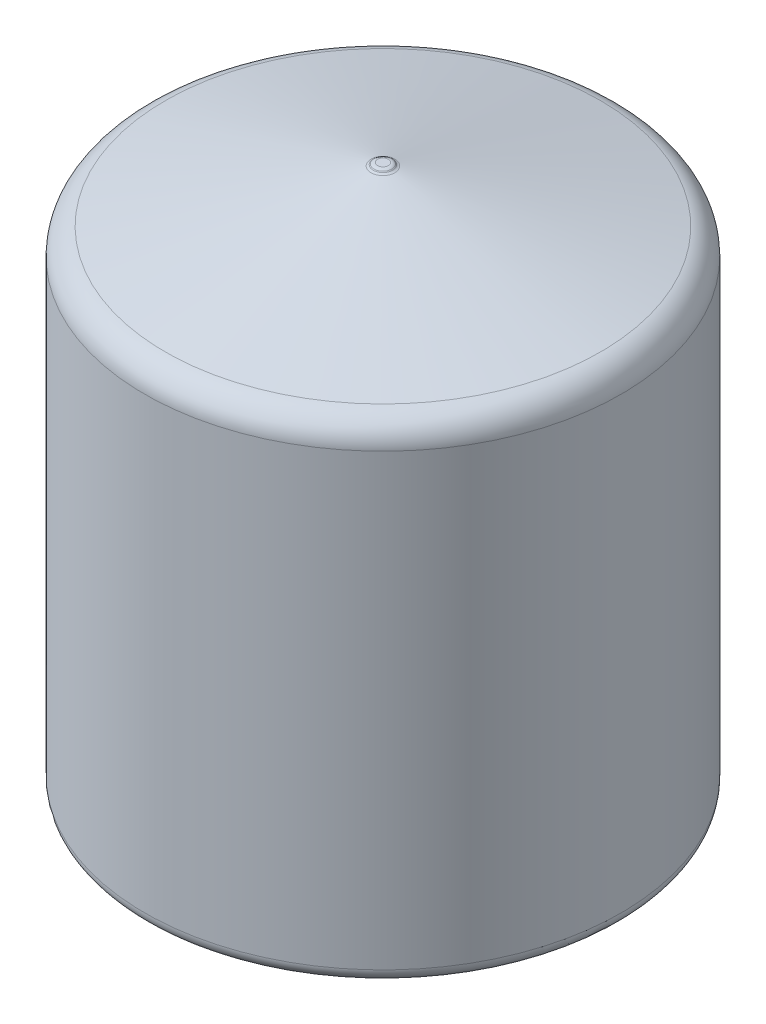
ISO-10303-21;
HEADER;
FILE_DESCRIPTION(('STEP AP214'),'2;1');
FILE_NAME('part.step','',(''),(''),'','','');
FILE_SCHEMA(('AUTOMOTIVE_DESIGN { 1 0 10303 214 1 1 1 1 }'));
ENDSEC;
DATA;
#1=APPLICATION_CONTEXT('core data for automotive mechanical design processes');
#2=APPLICATION_PROTOCOL_DEFINITION('international standard','automotive_design',2000,#1);
#3=PRODUCT_CONTEXT('',#1,'mechanical');
#4=PRODUCT('Part','Part','',(#3));
#5=PRODUCT_RELATED_PRODUCT_CATEGORY('part','',(#4));
#6=PRODUCT_DEFINITION_FORMATION('','',#4);
#7=PRODUCT_DEFINITION_CONTEXT('part definition',#1,'design');
#8=PRODUCT_DEFINITION('design','',#6,#7);
#9=PRODUCT_DEFINITION_SHAPE('','',#8);
#10=(LENGTH_UNIT() NAMED_UNIT(*) SI_UNIT(.MILLI.,.METRE.));
#11=(NAMED_UNIT(*) PLANE_ANGLE_UNIT() SI_UNIT($,.RADIAN.));
#12=(NAMED_UNIT(*) SI_UNIT($,.STERADIAN.) SOLID_ANGLE_UNIT());
#13=UNCERTAINTY_MEASURE_WITH_UNIT(LENGTH_MEASURE(1.E-05),#10,'distance_accuracy_value','');
#14=(GEOMETRIC_REPRESENTATION_CONTEXT(3) GLOBAL_UNCERTAINTY_ASSIGNED_CONTEXT((#13)) GLOBAL_UNIT_ASSIGNED_CONTEXT((#10,
#11,#12)) REPRESENTATION_CONTEXT('',''));
#15=CARTESIAN_POINT('',(0.,0.,0.));
#16=DIRECTION('',(0.,0.,1.));
#17=DIRECTION('',(1.,0.,0.));
#18=AXIS2_PLACEMENT_3D('',#15,#16,#17);
#19=CARTESIAN_POINT('',(0.,9.5,0.));
#20=DIRECTION('',(0.,-1.,0.));
#21=DIRECTION('',(0.,0.,-1.));
#22=AXIS2_PLACEMENT_3D('',#19,#20,#21);
#23=CYLINDRICAL_SURFACE('',#22,8.75);
#24=CARTESIAN_POINT('',(0.,0.5,0.));
#25=DIRECTION('',(0.,-1.,0.));
#26=DIRECTION('',(0.,0.,-1.));
#27=AXIS2_PLACEMENT_3D('',#24,#25,#26);
#28=CIRCLE('',#27,8.75);
#29=CARTESIAN_POINT('',(0.,0.5,-8.75));
#30=VERTEX_POINT('',#29);
#31=EDGE_CURVE('E11',#30,#30,#28,.F.);
#32=ORIENTED_EDGE('',*,*,#31,.T.);
#33=EDGE_LOOP('',(#32));
#34=FACE_BOUND('',#33,.T.);
#35=CARTESIAN_POINT('',(0.,17.,0.));
#36=DIRECTION('',(0.,-1.,0.));
#37=DIRECTION('',(0.,0.,-1.));
#38=AXIS2_PLACEMENT_3D('',#35,#36,#37);
#39=CIRCLE('',#38,8.75);
#40=CARTESIAN_POINT('',(0.,17.,-8.75));
#41=VERTEX_POINT('',#40);
#42=EDGE_CURVE('E91',#41,#41,#39,.T.);
#43=ORIENTED_EDGE('',*,*,#42,.T.);
#44=EDGE_LOOP('',(#43));
#45=FACE_BOUND('',#44,.T.);
#46=ADVANCED_FACE('F38',(#34,#45),#23,.T.);
#47=CARTESIAN_POINT('',(0.,17.,0.));
#48=DIRECTION('',(0.,-1.,0.));
#49=DIRECTION('',(0.,0.,-1.));
#50=AXIS2_PLACEMENT_3D('',#47,#48,#49);
#51=TOROIDAL_SURFACE('',#50,7.75,1.);
#52=CARTESIAN_POINT('',(0.,17.9692307692308,0.));
#53=DIRECTION('',(0.,-1.,0.));
#54=DIRECTION('',(0.,0.,-1.));
#55=AXIS2_PLACEMENT_3D('',#52,#53,#54);
#56=CIRCLE('',#55,7.99615384615385);
#57=CARTESIAN_POINT('',(0.,17.9692307692308,-7.99615384615384));
#58=VERTEX_POINT('',#57);
#59=EDGE_CURVE('E94',#58,#58,#56,.T.);
#60=ORIENTED_EDGE('',*,*,#59,.T.);
#61=EDGE_LOOP('',(#60));
#62=FACE_BOUND('',#61,.T.);
#63=ORIENTED_EDGE('',*,*,#42,.F.);
#64=EDGE_LOOP('',(#63));
#65=FACE_BOUND('',#64,.T.);
#66=ADVANCED_FACE('F67',(#62,#65),#51,.T.);
#67=CARTESIAN_POINT('',(0.,17.9692307692308,0.));
#68=DIRECTION('',(0.,-1.,0.));
#69=DIRECTION('',(0.,0.,-1.));
#70=AXIS2_PLACEMENT_3D('',#67,#68,#69);
#71=CONICAL_SURFACE('',#70,7.99615384615385,1.32208633770137);
#72=CARTESIAN_POINT('',(0.,19.8893432064493,0.));
#73=DIRECTION('',(0.,-1.,0.));
#74=DIRECTION('',(0.,0.,-1.));
#75=AXIS2_PLACEMENT_3D('',#72,#73,#74);
#76=CIRCLE('',#75,0.435711124605896);
#77=CARTESIAN_POINT('',(0.,19.8893432064493,-0.435711124605889));
#78=VERTEX_POINT('',#77);
#79=EDGE_CURVE('E99',#78,#78,#76,.T.);
#80=CARTESIAN_POINT('',(0.,19.8893432064493,-0.435711124605889));
#81=CARTESIAN_POINT('',(0.,19.8693420352283,-0.51446573628868));
#82=CARTESIAN_POINT('',(0.,19.8493408640072,-0.593220347971471));
#83=CARTESIAN_POINT('',(0.,19.8093385215652,-0.750729571337053));
#84=CARTESIAN_POINT('',(0.,19.7893373503442,-0.829484183019845));
#85=CARTESIAN_POINT('',(0.,19.7493350079021,-0.986993406385427));
#86=CARTESIAN_POINT('',(0.,19.7293338366811,-1.06574801806822));
#87=CARTESIAN_POINT('',(0.,19.689331494239,-1.2232572414338));
#88=CARTESIAN_POINT('',(0.,19.669330323018,-1.30201185311659));
#89=CARTESIAN_POINT('',(0.,19.629327980576,-1.45952107648217));
#90=CARTESIAN_POINT('',(0.,19.6093268093549,-1.53827568816497));
#91=CARTESIAN_POINT('',(0.,19.5693244669129,-1.69578491153055));
#92=CARTESIAN_POINT('',(0.,19.5493232956919,-1.77453952321334));
#93=CARTESIAN_POINT('',(0.,19.5093209532498,-1.93204874657892));
#94=CARTESIAN_POINT('',(0.,19.4893197820288,-2.01080335826171));
#95=CARTESIAN_POINT('',(0.,19.4493174395867,-2.16831258162729));
#96=CARTESIAN_POINT('',(0.,19.4293162683657,-2.24706719331009));
#97=CARTESIAN_POINT('',(0.,19.3893139259236,-2.40457641667567));
#98=CARTESIAN_POINT('',(0.,19.3693127547026,-2.48333102835846));
#99=CARTESIAN_POINT('',(0.,19.3293104122606,-2.64084025172404));
#100=CARTESIAN_POINT('',(0.,19.3093092410395,-2.71959486340683));
#101=CARTESIAN_POINT('',(0.,19.2693068985975,-2.87710408677242));
#102=CARTESIAN_POINT('',(0.,19.2493057273765,-2.95585869845521));
#103=CARTESIAN_POINT('',(0.,19.2093033849344,-3.11336792182079));
#104=CARTESIAN_POINT('',(0.,19.1893022137134,-3.19212253350358));
#105=CARTESIAN_POINT('',(0.,19.1492998712713,-3.34963175686916));
#106=CARTESIAN_POINT('',(0.,19.1292987000503,-3.42838636855195));
#107=CARTESIAN_POINT('',(0.,19.0892963576083,-3.58589559191753));
#108=CARTESIAN_POINT('',(0.,19.0692951863872,-3.66465020360033));
#109=CARTESIAN_POINT('',(0.,19.0292928439452,-3.82215942696591));
#110=CARTESIAN_POINT('',(0.,19.0092916727241,-3.9009140386487));
#111=CARTESIAN_POINT('',(0.,18.9692893302821,-4.05842326201428));
#112=CARTESIAN_POINT('',(0.,18.9492881590611,-4.13717787369707));
#113=CARTESIAN_POINT('',(0.,18.909285816619,-4.29468709706266));
#114=CARTESIAN_POINT('',(0.,18.889284645398,-4.37344170874545));
#115=CARTESIAN_POINT('',(0.,18.8492823029559,-4.53095093211103));
#116=CARTESIAN_POINT('',(0.,18.8292811317349,-4.60970554379382));
#117=CARTESIAN_POINT('',(0.,18.7892787892929,-4.7672147671594));
#118=CARTESIAN_POINT('',(0.,18.7692776180718,-4.84596937884219));
#119=CARTESIAN_POINT('',(0.,18.7292752756298,-5.00347860220778));
#120=CARTESIAN_POINT('',(0.,18.7092741044087,-5.08223321389057));
#121=CARTESIAN_POINT('',(0.,18.6692717619667,-5.23974243725615));
#122=CARTESIAN_POINT('',(0.,18.6492705907457,-5.31849704893894));
#123=CARTESIAN_POINT('',(0.,18.6092682483036,-5.47600627230452));
#124=CARTESIAN_POINT('',(0.,18.5892670770826,-5.55476088398731));
#125=CARTESIAN_POINT('',(0.,18.5492647346405,-5.7122701073529));
#126=CARTESIAN_POINT('',(0.,18.5292635634195,-5.79102471903569));
#127=CARTESIAN_POINT('',(0.,18.4892612209775,-5.94853394240127));
#128=CARTESIAN_POINT('',(0.,18.4692600497564,-6.02728855408406));
#129=CARTESIAN_POINT('',(0.,18.4292577073144,-6.18479777744964));
#130=CARTESIAN_POINT('',(0.,18.4092565360934,-6.26355238913244));
#131=CARTESIAN_POINT('',(0.,18.3692541936513,-6.42106161249802));
#132=CARTESIAN_POINT('',(0.,18.3492530224303,-6.49981622418081));
#133=CARTESIAN_POINT('',(0.,18.3092506799882,-6.65732544754639));
#134=CARTESIAN_POINT('',(0.,18.2892495087672,-6.73608005922918));
#135=CARTESIAN_POINT('',(0.,18.2492471663251,-6.89358928259476));
#136=CARTESIAN_POINT('',(0.,18.2292459951041,-6.97234389427756));
#137=CARTESIAN_POINT('',(0.,18.1892436526621,-7.12985311764314));
#138=CARTESIAN_POINT('',(0.,18.169242481441,-7.20860772932593));
#139=CARTESIAN_POINT('',(0.,18.129240138999,-7.36611695269151));
#140=CARTESIAN_POINT('',(0.,18.109238967778,-7.4448715643743));
#141=CARTESIAN_POINT('',(0.,18.0692366253359,-7.60238078773989));
#142=CARTESIAN_POINT('',(0.,18.0492354541149,-7.68113539942268));
#143=CARTESIAN_POINT('',(0.,18.0092331116728,-7.83864462278826));
#144=CARTESIAN_POINT('',(0.,17.9892319404518,-7.91739923447105));
#145=CARTESIAN_POINT('',(0.,17.9692307692308,-7.99615384615384));
#146=B_SPLINE_CURVE_WITH_KNOTS('',3,(#80,#81,#82,#83,#84,#85,#86,#87,#88,#89,#90,#91,#92,#93,
#94,#95,#96,#97,#98,#99,#100,#101,#102,#103,#104,#105,#106,#107,#108,#109,#110,#111,#112,#113,
#114,#115,#116,#117,#118,#119,#120,#121,#122,#123,#124,#125,#126,#127,#128,#129,#130,#131,#132,
#133,#134,#135,#136,#137,#138,#139,#140,#141,#142,#143,#144,#145),.UNSPECIFIED.,.F.,.F.,(4,2,2,
2,2,2,2,2,2,2,2,2,2,2,2,2,2,2,2,2,2,2,2,2,2,2,2,2,2,2,2,2,4),(0.,0.243764274256258,
0.487528548512517,0.731292822768777,0.975057097025034,1.21882137128129,1.46258564553755,
1.70634991979381,1.95011419405007,2.19387846830633,2.43764274256258,2.68140701681884,
2.9251712910751,3.16893556533136,3.41269983958762,3.65646411384388,3.90022838810013,
4.14399266235639,4.38775693661265,4.63152121086891,4.87528548512517,5.11904975938142,
5.36281403363768,5.60657830789394,5.8503425821502,6.09410685640646,6.33787113066272,
6.58163540491897,6.82539967917523,7.06916395343149,7.31292822768775,7.55669250194401,
7.80045677620027),.UNSPECIFIED.);
#147=EDGE_CURVE('BSEAM73',#78,#58,#146,.T.);
#148=ORIENTED_EDGE('',*,*,#79,.T.);
#149=ORIENTED_EDGE('',*,*,#59,.F.);
#150=ORIENTED_EDGE('',*,*,#147,.T.);
#151=ORIENTED_EDGE('',*,*,#147,.F.);
#152=EDGE_LOOP('',(#148,#150,#149,#151));
#153=FACE_BOUND('',#152,.T.);
#154=ADVANCED_FACE('F73',(#153),#71,.T.);
#155=CARTESIAN_POINT('',(0.,20.0831893602955,0.));
#156=DIRECTION('',(0.,-1.,0.));
#157=DIRECTION('',(0.,0.,-1.));
#158=AXIS2_PLACEMENT_3D('',#155,#156,#157);
#159=TOROIDAL_SURFACE('',#158,0.484941893836666,0.199999999999999);
#160=CARTESIAN_POINT('',(0.,19.9296565099702,0.));
#161=DIRECTION('',(0.,-1.,0.));
#162=DIRECTION('',(0.,0.,-1.));
#163=AXIS2_PLACEMENT_3D('',#160,#161,#162);
#164=CIRCLE('',#163,0.356771445327667);
#165=CARTESIAN_POINT('',(0.,19.9296565099702,-0.356771445327667));
#166=VERTEX_POINT('',#165);
#167=EDGE_CURVE('E102',#166,#166,#164,.T.);
#168=ORIENTED_EDGE('',*,*,#167,.T.);
#169=EDGE_LOOP('',(#168));
#170=FACE_BOUND('',#169,.T.);
#171=ORIENTED_EDGE('',*,*,#79,.F.);
#172=EDGE_LOOP('',(#171));
#173=FACE_BOUND('',#172,.T.);
#174=ADVANCED_FACE('F178',(#170,#173),#159,.F.);
#175=CARTESIAN_POINT('',(0.,19.9296565099702,0.));
#176=DIRECTION('',(0.,-1.,0.));
#177=DIRECTION('',(0.,0.,-1.));
#178=AXIS2_PLACEMENT_3D('',#175,#176,#177);
#179=CONICAL_SURFACE('',#178,0.356771445327667,0.875188398759165);
#180=CARTESIAN_POINT('',(0.,19.9535328503252,0.));
#181=DIRECTION('',(0.,-1.,0.));
#182=DIRECTION('',(0.,0.,-1.));
#183=AXIS2_PLACEMENT_3D('',#180,#181,#182);
#184=CIRCLE('',#183,0.328170448509115);
#185=CARTESIAN_POINT('',(0.,19.9535328503252,-0.328170448509115));
#186=VERTEX_POINT('',#185);
#187=EDGE_CURVE('E105',#186,#186,#184,.T.);
#188=ORIENTED_EDGE('',*,*,#187,.T.);
#189=EDGE_LOOP('',(#188));
#190=FACE_BOUND('',#189,.T.);
#191=ORIENTED_EDGE('',*,*,#167,.F.);
#192=EDGE_LOOP('',(#191));
#193=FACE_BOUND('',#192,.T.);
#194=ADVANCED_FACE('F168',(#190,#193),#179,.T.);
#195=CARTESIAN_POINT('',(0.,19.8,0.));
#196=DIRECTION('',(0.,-1.,0.));
#197=DIRECTION('',(0.,0.,-1.));
#198=AXIS2_PLACEMENT_3D('',#195,#196,#197);
#199=TOROIDAL_SURFACE('',#198,0.2,0.199999999999999);
#200=CARTESIAN_POINT('',(0.,20.,0.));
#201=DIRECTION('',(0.,-1.,0.));
#202=DIRECTION('',(0.,0.,-1.));
#203=AXIS2_PLACEMENT_3D('',#200,#201,#202);
#204=CIRCLE('',#203,0.2);
#205=CARTESIAN_POINT('',(0.,20.,-0.2));
#206=VERTEX_POINT('',#205);
#207=EDGE_CURVE('E108',#206,#206,#204,.T.);
#208=ORIENTED_EDGE('',*,*,#207,.T.);
#209=EDGE_LOOP('',(#208));
#210=FACE_BOUND('',#209,.T.);
#211=ORIENTED_EDGE('',*,*,#187,.F.);
#212=EDGE_LOOP('',(#211));
#213=FACE_BOUND('',#212,.T.);
#214=ADVANCED_FACE('F62',(#210,#213),#199,.T.);
#215=CARTESIAN_POINT('',(0.2,20.,0.));
#216=DIRECTION('',(0.,1.,0.));
#217=DIRECTION('',(0.,0.,1.));
#218=AXIS2_PLACEMENT_3D('',#215,#216,#217);
#219=PLANE('',#218);
#220=ORIENTED_EDGE('',*,*,#207,.F.);
#221=EDGE_LOOP('',(#220));
#222=FACE_BOUND('',#221,.T.);
#223=ADVANCED_FACE('F52',(#222),#219,.T.);
#224=CARTESIAN_POINT('',(0.,19.5,0.));
#225=DIRECTION('',(0.,-1.,0.));
#226=DIRECTION('',(0.,0.,-1.));
#227=AXIS2_PLACEMENT_3D('',#224,#225,#226);
#228=CONICAL_SURFACE('',#227,0.,0.785398163397451);
#229=CARTESIAN_POINT('',(0.,18.7872340425532,0.));
#230=DIRECTION('',(0.,-1.,0.));
#231=DIRECTION('',(0.,0.,-1.));
#232=AXIS2_PLACEMENT_3D('',#229,#230,#231);
#233=CIRCLE('',#232,0.712765957446813);
#234=CARTESIAN_POINT('',(0.,18.7872340425532,-0.712765957446807));
#235=VERTEX_POINT('',#234);
#236=EDGE_CURVE('E111',#235,#235,#233,.T.);
#237=ORIENTED_EDGE('',*,*,#236,.T.);
#238=EDGE_LOOP('',(#237));
#239=FACE_BOUND('',#238,.T.);
#240=CARTESIAN_POINT('',(0.,19.5,0.));
#241=VERTEX_POINT('',#240);
#242=VERTEX_LOOP('',#241);
#243=FACE_BOUND('',#242,.T.);
#244=ADVANCED_FACE('F49',(#239,#243),#228,.F.);
#245=CARTESIAN_POINT('',(0.,18.7872340425532,0.));
#246=DIRECTION('',(0.,-1.,0.));
#247=DIRECTION('',(0.,0.,-1.));
#248=AXIS2_PLACEMENT_3D('',#245,#246,#247);
#249=CONICAL_SURFACE('',#248,0.712765957446813,1.32208633770137);
#250=CARTESIAN_POINT('',(0.,17.,0.));
#251=DIRECTION('',(0.,-1.,0.));
#252=DIRECTION('',(0.,0.,-1.));
#253=AXIS2_PLACEMENT_3D('',#250,#251,#252);
#254=CIRCLE('',#253,7.75);
#255=CARTESIAN_POINT('',(0.,17.,-7.75));
#256=VERTEX_POINT('',#255);
#257=EDGE_CURVE('E113',#256,#256,#254,.T.);
#258=CARTESIAN_POINT('',(0.,17.,-7.75));
#259=CARTESIAN_POINT('',(0.,17.0186170212766,-7.6766954787234));
#260=CARTESIAN_POINT('',(0.,17.0372340425532,-7.60339095744681));
#261=CARTESIAN_POINT('',(0.,17.0744680851064,-7.45678191489361));
#262=CARTESIAN_POINT('',(0.,17.093085106383,-7.38347739361702));
#263=CARTESIAN_POINT('',(0.,17.1303191489362,-7.23686835106383));
#264=CARTESIAN_POINT('',(0.,17.1489361702128,-7.16356382978723));
#265=CARTESIAN_POINT('',(0.,17.186170212766,-7.01695478723404));
#266=CARTESIAN_POINT('',(0.,17.2047872340426,-6.94365026595744));
#267=CARTESIAN_POINT('',(0.,17.2420212765958,-6.79704122340425));
#268=CARTESIAN_POINT('',(0.,17.2606382978723,-6.72373670212766));
#269=CARTESIAN_POINT('',(0.,17.2978723404255,-6.57712765957447));
#270=CARTESIAN_POINT('',(0.,17.3164893617021,-6.50382313829787));
#271=CARTESIAN_POINT('',(0.,17.3537234042553,-6.35721409574468));
#272=CARTESIAN_POINT('',(0.,17.3723404255319,-6.28390957446808));
#273=CARTESIAN_POINT('',(0.,17.4095744680851,-6.13730053191489));
#274=CARTESIAN_POINT('',(0.,17.4281914893617,-6.0639960106383));
#275=CARTESIAN_POINT('',(0.,17.4654255319149,-5.9173869680851));
#276=CARTESIAN_POINT('',(0.,17.4840425531915,-5.84408244680851));
#277=CARTESIAN_POINT('',(0.,17.5212765957447,-5.69747340425532));
#278=CARTESIAN_POINT('',(0.,17.5398936170213,-5.62416888297872));
#279=CARTESIAN_POINT('',(0.,17.5771276595745,-5.47755984042553));
#280=CARTESIAN_POINT('',(0.,17.5957446808511,-5.40425531914893));
#281=CARTESIAN_POINT('',(0.,17.6329787234043,-5.25764627659574));
#282=CARTESIAN_POINT('',(0.,17.6515957446809,-5.18434175531915));
#283=CARTESIAN_POINT('',(0.,17.688829787234,-5.03773271276596));
#284=CARTESIAN_POINT('',(0.,17.7074468085106,-4.96442819148936));
#285=CARTESIAN_POINT('',(0.,17.7446808510638,-4.81781914893617));
#286=CARTESIAN_POINT('',(0.,17.7632978723404,-4.74451462765957));
#287=CARTESIAN_POINT('',(0.,17.8005319148936,-4.59790558510638));
#288=CARTESIAN_POINT('',(0.,17.8191489361702,-4.52460106382978));
#289=CARTESIAN_POINT('',(0.,17.8563829787234,-4.37799202127659));
#290=CARTESIAN_POINT('',(0.,17.875,-4.3046875));
#291=CARTESIAN_POINT('',(0.,17.9122340425532,-4.15807845744681));
#292=CARTESIAN_POINT('',(0.,17.9308510638298,-4.08477393617021));
#293=CARTESIAN_POINT('',(0.,17.968085106383,-3.93816489361702));
#294=CARTESIAN_POINT('',(0.,17.9867021276596,-3.86486037234042));
#295=CARTESIAN_POINT('',(0.,18.0239361702128,-3.71825132978723));
#296=CARTESIAN_POINT('',(0.,18.0425531914894,-3.64494680851064));
#297=CARTESIAN_POINT('',(0.,18.0797872340426,-3.49833776595744));
#298=CARTESIAN_POINT('',(0.,18.0984042553191,-3.42503324468085));
#299=CARTESIAN_POINT('',(0.,18.1356382978723,-3.27842420212766));
#300=CARTESIAN_POINT('',(0.,18.1542553191489,-3.20511968085106));
#301=CARTESIAN_POINT('',(0.,18.1914893617021,-3.05851063829787));
#302=CARTESIAN_POINT('',(0.,18.2101063829787,-2.98520611702127));
#303=CARTESIAN_POINT('',(0.,18.2473404255319,-2.83859707446808));
#304=CARTESIAN_POINT('',(0.,18.2659574468085,-2.76529255319149));
#305=CARTESIAN_POINT('',(0.,18.3031914893617,-2.6186835106383));
#306=CARTESIAN_POINT('',(0.,18.3218085106383,-2.5453789893617));
#307=CARTESIAN_POINT('',(0.,18.3590425531915,-2.39876994680851));
#308=CARTESIAN_POINT('',(0.,18.3776595744681,-2.32546542553191));
#309=CARTESIAN_POINT('',(0.,18.4148936170213,-2.17885638297872));
#310=CARTESIAN_POINT('',(0.,18.4335106382979,-2.10555186170213));
#311=CARTESIAN_POINT('',(0.,18.4707446808511,-1.95894281914893));
#312=CARTESIAN_POINT('',(0.,18.4893617021277,-1.88563829787234));
#313=CARTESIAN_POINT('',(0.,18.5265957446809,-1.73902925531915));
#314=CARTESIAN_POINT('',(0.,18.5452127659574,-1.66572473404255));
#315=CARTESIAN_POINT('',(0.,18.5824468085106,-1.51911569148936));
#316=CARTESIAN_POINT('',(0.,18.6010638297872,-1.44581117021276));
#317=CARTESIAN_POINT('',(0.,18.6382978723404,-1.29920212765957));
#318=CARTESIAN_POINT('',(0.,18.656914893617,-1.22589760638298));
#319=CARTESIAN_POINT('',(0.,18.6941489361702,-1.07928856382979));
#320=CARTESIAN_POINT('',(0.,18.7127659574468,-1.00598404255319));
#321=CARTESIAN_POINT('',(0.,18.75,-0.859374999999998));
#322=CARTESIAN_POINT('',(0.,18.7686170212766,-0.786070478723403));
#323=CARTESIAN_POINT('',(0.,18.7872340425532,-0.712765957446807));
#324=B_SPLINE_CURVE_WITH_KNOTS('',3,(#258,#259,#260,#261,#262,#263,#264,#265,#266,#267,#268,
#269,#270,#271,#272,#273,#274,#275,#276,#277,#278,#279,#280,#281,#282,#283,#284,#285,#286,#287,
#288,#289,#290,#291,#292,#293,#294,#295,#296,#297,#298,#299,#300,#301,#302,#303,#304,#305,#306,
#307,#308,#309,#310,#311,#312,#313,#314,#315,#316,#317,#318,#319,#320,#321,#322,#323),
.UNSPECIFIED.,.F.,.F.,(4,2,2,2,2,2,2,2,2,2,2,2,2,2,2,2,2,2,2,2,2,2,2,2,2,2,2,2,2,2,2,2,4),(0.,
0.226894946808509,0.45378989361702,0.680684840425531,0.907579787234042,1.13447473404255,
1.36136968085106,1.58826462765957,1.81515957446808,2.04205452127659,2.2689494680851,
2.49584441489362,2.72273936170213,2.94963430851064,3.17652925531915,3.40342420212766,
3.63031914893617,3.85721409574468,4.08410904255319,4.3110039893617,4.53789893617021,
4.76479388297872,4.99168882978723,5.21858377659574,5.44547872340425,5.67237367021276,
5.89926861702127,6.12616356382978,6.35305851063829,6.5799534574468,6.80684840425532,
7.03374335106383,7.26063829787233),.UNSPECIFIED.);
#325=EDGE_CURVE('BSEAM51',#256,#235,#324,.T.);
#326=ORIENTED_EDGE('',*,*,#257,.T.);
#327=ORIENTED_EDGE('',*,*,#236,.F.);
#328=ORIENTED_EDGE('',*,*,#325,.T.);
#329=ORIENTED_EDGE('',*,*,#325,.F.);
#330=EDGE_LOOP('',(#326,#328,#327,#329));
#331=FACE_BOUND('',#330,.T.);
#332=ADVANCED_FACE('F51',(#331),#249,.F.);
#333=CARTESIAN_POINT('',(0.,9.5,0.));
#334=DIRECTION('',(0.,-1.,0.));
#335=DIRECTION('',(0.,0.,-1.));
#336=AXIS2_PLACEMENT_3D('',#333,#334,#335);
#337=CYLINDRICAL_SURFACE('',#336,7.75);
#338=CARTESIAN_POINT('',(0.,0.5,0.));
#339=DIRECTION('',(0.,-1.,0.));
#340=DIRECTION('',(0.,0.,-1.));
#341=AXIS2_PLACEMENT_3D('',#338,#339,#340);
#342=CIRCLE('',#341,7.75);
#343=CARTESIAN_POINT('',(0.,0.5,-7.75));
#344=VERTEX_POINT('',#343);
#345=EDGE_CURVE('E46',#344,#344,#342,.T.);
#346=ORIENTED_EDGE('',*,*,#345,.T.);
#347=EDGE_LOOP('',(#346));
#348=FACE_BOUND('',#347,.T.);
#349=ORIENTED_EDGE('',*,*,#257,.F.);
#350=EDGE_LOOP('',(#349));
#351=FACE_BOUND('',#350,.T.);
#352=ADVANCED_FACE('F59',(#348,#351),#337,.F.);
#353=CARTESIAN_POINT('',(0.,0.5,0.));
#354=DIRECTION('',(0.,-1.,0.));
#355=DIRECTION('',(0.,0.,-1.));
#356=AXIS2_PLACEMENT_3D('',#353,#354,#355);
#357=TOROIDAL_SURFACE('',#356,8.25,0.5);
#358=ORIENTED_EDGE('',*,*,#31,.F.);
#359=EDGE_LOOP('',(#358));
#360=FACE_BOUND('',#359,.T.);
#361=CARTESIAN_POINT('',(0.,0.,0.));
#362=DIRECTION('',(0.,-1.,0.));
#363=DIRECTION('',(0.,0.,-1.));
#364=AXIS2_PLACEMENT_3D('',#361,#362,#363);
#365=CIRCLE('',#364,8.25);
#366=CARTESIAN_POINT('',(0.,0.,-8.25));
#367=VERTEX_POINT('',#366);
#368=EDGE_CURVE('E42',#367,#367,#365,.T.);
#369=ORIENTED_EDGE('',*,*,#368,.F.);
#370=EDGE_LOOP('',(#369));
#371=FACE_BOUND('',#370,.T.);
#372=ADVANCED_FACE('F40',(#360,#371),#357,.T.);
#373=CARTESIAN_POINT('',(0.,0.5,0.));
#374=DIRECTION('',(0.,-1.,0.));
#375=DIRECTION('',(0.,0.,-1.));
#376=AXIS2_PLACEMENT_3D('',#373,#374,#375);
#377=TOROIDAL_SURFACE('',#376,8.25,0.5);
#378=ORIENTED_EDGE('',*,*,#368,.T.);
#379=EDGE_LOOP('',(#378));
#380=FACE_BOUND('',#379,.T.);
#381=ORIENTED_EDGE('',*,*,#345,.F.);
#382=EDGE_LOOP('',(#381));
#383=FACE_BOUND('',#382,.T.);
#384=ADVANCED_FACE('F78',(#380,#383),#377,.T.);
#385=CLOSED_SHELL('',(#46,#66,#154,#174,#194,#214,#223,#244,#332,#352,#372,#384));
#386=MANIFOLD_SOLID_BREP('B2',#385);
#387=ADVANCED_BREP_SHAPE_REPRESENTATION('',(#18,#386),#14);
#388=SHAPE_DEFINITION_REPRESENTATION(#9,#387);
ENDSEC;
END-ISO-10303-21;
